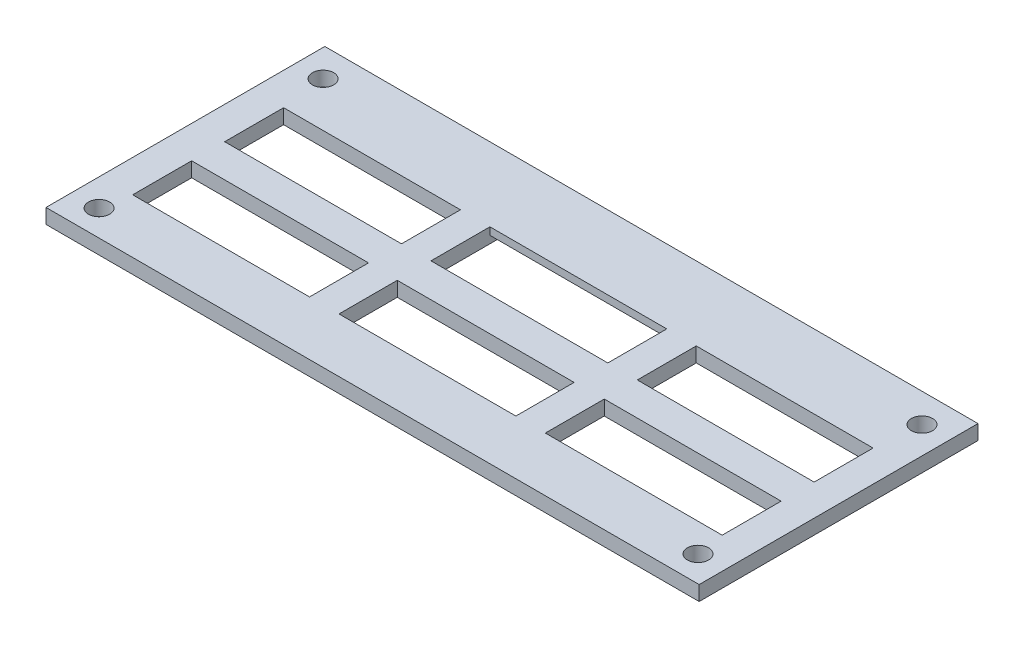
ISO-10303-21;
HEADER;
FILE_DESCRIPTION(('STEP AP214'),'2;1');
FILE_NAME('part.step','',(''),(''),'','','');
FILE_SCHEMA(('AUTOMOTIVE_DESIGN { 1 0 10303 214 1 1 1 1 }'));
ENDSEC;
DATA;
#1=APPLICATION_CONTEXT('core data for automotive mechanical design processes');
#2=APPLICATION_PROTOCOL_DEFINITION('international standard','automotive_design',2000,#1);
#3=PRODUCT_CONTEXT('',#1,'mechanical');
#4=PRODUCT('Part','Part','',(#3));
#5=PRODUCT_RELATED_PRODUCT_CATEGORY('part','',(#4));
#6=PRODUCT_DEFINITION_FORMATION('','',#4);
#7=PRODUCT_DEFINITION_CONTEXT('part definition',#1,'design');
#8=PRODUCT_DEFINITION('design','',#6,#7);
#9=PRODUCT_DEFINITION_SHAPE('','',#8);
#10=(LENGTH_UNIT() NAMED_UNIT(*) SI_UNIT(.MILLI.,.METRE.));
#11=(NAMED_UNIT(*) PLANE_ANGLE_UNIT() SI_UNIT($,.RADIAN.));
#12=(NAMED_UNIT(*) SI_UNIT($,.STERADIAN.) SOLID_ANGLE_UNIT());
#13=UNCERTAINTY_MEASURE_WITH_UNIT(LENGTH_MEASURE(1.E-05),#10,'distance_accuracy_value','');
#14=(GEOMETRIC_REPRESENTATION_CONTEXT(3) GLOBAL_UNCERTAINTY_ASSIGNED_CONTEXT((#13)) GLOBAL_UNIT_ASSIGNED_CONTEXT((#10,
#11,#12)) REPRESENTATION_CONTEXT('',''));
#15=CARTESIAN_POINT('',(0.,0.,0.));
#16=DIRECTION('',(0.,0.,1.));
#17=DIRECTION('',(1.,0.,0.));
#18=AXIS2_PLACEMENT_3D('',#15,#16,#17);
#19=CARTESIAN_POINT('',(0.,3.175,-31.6916788918607));
#20=DIRECTION('',(0.,0.,1.));
#21=DIRECTION('',(1.,0.,0.));
#22=AXIS2_PLACEMENT_3D('',#19,#20,#21);
#23=PLANE('',#22);
#24=DIRECTION('',(0.,-1.,0.));
#25=VECTOR('',#24,1.);
#26=CARTESIAN_POINT('',(19.8707913959619,3.175,-31.6916788918608));
#27=LINE('',#26,#25);
#28=CARTESIAN_POINT('',(19.8707913959619,1.5875,-31.6916788918608));
#29=VERTEX_POINT('',#28);
#30=CARTESIAN_POINT('',(19.8707913959619,0.,-31.6916788918608));
#31=VERTEX_POINT('',#30);
#32=EDGE_CURVE('E38',#29,#31,#27,.T.);
#33=ORIENTED_EDGE('',*,*,#32,.F.);
#34=DIRECTION('',(-1.,0.,0.));
#35=VECTOR('',#34,1.);
#36=CARTESIAN_POINT('',(-18.2292086040381,1.5875,-31.6916788918608));
#37=LINE('',#36,#35);
#38=CARTESIAN_POINT('',(-18.2292086040381,1.5875,-31.6916788918608));
#39=VERTEX_POINT('',#38);
#40=EDGE_CURVE('E421',#29,#39,#37,.T.);
#41=ORIENTED_EDGE('',*,*,#40,.T.);
#42=DIRECTION('',(0.,-1.,0.));
#43=VECTOR('',#42,1.);
#44=CARTESIAN_POINT('',(-18.2292086040381,3.175,-31.6916788918608));
#45=LINE('',#44,#43);
#46=CARTESIAN_POINT('',(-18.2292086040381,0.,-31.6916788918608));
#47=VERTEX_POINT('',#46);
#48=EDGE_CURVE('E269',#39,#47,#45,.T.);
#49=ORIENTED_EDGE('',*,*,#48,.T.);
#50=DIRECTION('',(-1.,0.,0.));
#51=VECTOR('',#50,1.);
#52=CARTESIAN_POINT('',(0.,0.,-31.6916788918607));
#53=LINE('',#52,#51);
#54=EDGE_CURVE('E270',#31,#47,#53,.T.);
#55=ORIENTED_EDGE('',*,*,#54,.F.);
#56=EDGE_LOOP('',(#33,#41,#49,#55));
#57=FACE_BOUND('',#56,.T.);
#58=ADVANCED_FACE('F35',(#57),#23,.T.);
#59=CARTESIAN_POINT('',(0.,3.175,-22.0933789859211));
#60=DIRECTION('',(0.,0.,-1.));
#61=DIRECTION('',(-1.,0.,0.));
#62=AXIS2_PLACEMENT_3D('',#59,#60,#61);
#63=PLANE('',#62);
#64=DIRECTION('',(1.,0.,0.));
#65=VECTOR('',#64,1.);
#66=CARTESIAN_POINT('',(0.,0.,-22.0933789859211));
#67=LINE('',#66,#65);
#68=CARTESIAN_POINT('',(-62.6792086040381,0.,-22.0933789859211));
#69=VERTEX_POINT('',#68);
#70=CARTESIAN_POINT('',(-24.579208604038,0.,-22.0933789859211));
#71=VERTEX_POINT('',#70);
#72=EDGE_CURVE('E332',#69,#71,#67,.T.);
#73=ORIENTED_EDGE('',*,*,#72,.T.);
#74=DIRECTION('',(0.,-1.,0.));
#75=VECTOR('',#74,1.);
#76=CARTESIAN_POINT('',(-24.579208604038,3.175,-22.0933789859211));
#77=LINE('',#76,#75);
#78=CARTESIAN_POINT('',(-24.579208604038,3.175,-22.0933789859211));
#79=VERTEX_POINT('',#78);
#80=EDGE_CURVE('E11',#79,#71,#77,.T.);
#81=ORIENTED_EDGE('',*,*,#80,.F.);
#82=DIRECTION('',(1.,0.,0.));
#83=VECTOR('',#82,1.);
#84=CARTESIAN_POINT('',(0.,3.175,-22.0933789859211));
#85=LINE('',#84,#83);
#86=CARTESIAN_POINT('',(-62.6792086040381,3.175,-22.0933789859211));
#87=VERTEX_POINT('',#86);
#88=EDGE_CURVE('E238',#87,#79,#85,.T.);
#89=ORIENTED_EDGE('',*,*,#88,.F.);
#90=DIRECTION('',(0.,-1.,0.));
#91=VECTOR('',#90,1.);
#92=CARTESIAN_POINT('',(-62.6792086040381,3.175,-22.0933789859211));
#93=LINE('',#92,#91);
#94=EDGE_CURVE('E349',#87,#69,#93,.T.);
#95=ORIENTED_EDGE('',*,*,#94,.T.);
#96=EDGE_LOOP('',(#73,#81,#89,#95));
#97=FACE_BOUND('',#96,.T.);
#98=ADVANCED_FACE('F535',(#97),#63,.F.);
#99=CARTESIAN_POINT('',(-24.579208604038,3.175,0.));
#100=DIRECTION('',(1.,0.,0.));
#101=DIRECTION('',(0.,0.,-1.));
#102=AXIS2_PLACEMENT_3D('',#99,#100,#101);
#103=PLANE('',#102);
#104=DIRECTION('',(0.,0.,1.));
#105=VECTOR('',#104,1.);
#106=CARTESIAN_POINT('',(-24.579208604038,0.,0.));
#107=LINE('',#106,#105);
#108=CARTESIAN_POINT('',(-24.579208604038,0.,-9.39337898592111));
#109=VERTEX_POINT('',#108);
#110=EDGE_CURVE('E245',#71,#109,#107,.T.);
#111=ORIENTED_EDGE('',*,*,#110,.T.);
#112=DIRECTION('',(0.,-1.,0.));
#113=VECTOR('',#112,1.);
#114=CARTESIAN_POINT('',(-24.579208604038,3.175,-9.39337898592111));
#115=LINE('',#114,#113);
#116=CARTESIAN_POINT('',(-24.579208604038,3.175,-9.39337898592111));
#117=VERTEX_POINT('',#116);
#118=EDGE_CURVE('E43',#117,#109,#115,.T.);
#119=ORIENTED_EDGE('',*,*,#118,.F.);
#120=DIRECTION('',(0.,0.,1.));
#121=VECTOR('',#120,1.);
#122=CARTESIAN_POINT('',(-24.579208604038,3.175,0.));
#123=LINE('',#122,#121);
#124=EDGE_CURVE('E230',#79,#117,#123,.T.);
#125=ORIENTED_EDGE('',*,*,#124,.F.);
#126=ORIENTED_EDGE('',*,*,#80,.T.);
#127=EDGE_LOOP('',(#111,#119,#125,#126));
#128=FACE_BOUND('',#127,.T.);
#129=ADVANCED_FACE('F244',(#128),#103,.F.);
#130=CARTESIAN_POINT('',(0.,3.175,-9.39337898592111));
#131=DIRECTION('',(0.,0.,1.));
#132=DIRECTION('',(1.,0.,0.));
#133=AXIS2_PLACEMENT_3D('',#130,#131,#132);
#134=PLANE('',#133);
#135=DIRECTION('',(-1.,0.,0.));
#136=VECTOR('',#135,1.);
#137=CARTESIAN_POINT('',(0.,0.,-9.39337898592111));
#138=LINE('',#137,#136);
#139=CARTESIAN_POINT('',(-62.6792086040381,0.,-9.39337898592111));
#140=VERTEX_POINT('',#139);
#141=EDGE_CURVE('E335',#109,#140,#138,.T.);
#142=ORIENTED_EDGE('',*,*,#141,.T.);
#143=DIRECTION('',(0.,-1.,0.));
#144=VECTOR('',#143,1.);
#145=CARTESIAN_POINT('',(-62.6792086040381,3.175,-9.39337898592111));
#146=LINE('',#145,#144);
#147=CARTESIAN_POINT('',(-62.6792086040381,3.175,-9.39337898592111));
#148=VERTEX_POINT('',#147);
#149=EDGE_CURVE('E248',#148,#140,#146,.T.);
#150=ORIENTED_EDGE('',*,*,#149,.F.);
#151=DIRECTION('',(-1.,0.,0.));
#152=VECTOR('',#151,1.);
#153=CARTESIAN_POINT('',(0.,3.175,-9.39337898592111));
#154=LINE('',#153,#152);
#155=EDGE_CURVE('E235',#117,#148,#154,.T.);
#156=ORIENTED_EDGE('',*,*,#155,.F.);
#157=ORIENTED_EDGE('',*,*,#118,.T.);
#158=EDGE_LOOP('',(#142,#150,#156,#157));
#159=FACE_BOUND('',#158,.T.);
#160=ADVANCED_FACE('F250',(#159),#134,.F.);
#161=CARTESIAN_POINT('',(71.0532617855184,3.175,0.));
#162=DIRECTION('',(-1.,0.,0.));
#163=DIRECTION('',(0.,0.,1.));
#164=AXIS2_PLACEMENT_3D('',#161,#162,#163);
#165=PLANE('',#164);
#166=DIRECTION('',(0.,0.,-1.));
#167=VECTOR('',#166,1.);
#168=CARTESIAN_POINT('',(71.0532617855184,0.,0.));
#169=LINE('',#168,#167);
#170=CARTESIAN_POINT('',(71.0532617855184,0.,22.1095020845851));
#171=VERTEX_POINT('',#170);
#172=CARTESIAN_POINT('',(71.0532617855184,0.,-37.9614970609159));
#173=VERTEX_POINT('',#172);
#174=EDGE_CURVE('E321',#171,#173,#169,.T.);
#175=ORIENTED_EDGE('',*,*,#174,.T.);
#176=DIRECTION('',(0.,-1.,0.));
#177=VECTOR('',#176,1.);
#178=CARTESIAN_POINT('',(71.0532617855184,3.175,-37.9614970609159));
#179=LINE('',#178,#177);
#180=CARTESIAN_POINT('',(71.0532617855184,3.175,-37.9614970609159));
#181=VERTEX_POINT('',#180);
#182=EDGE_CURVE('E351',#181,#173,#179,.T.);
#183=ORIENTED_EDGE('',*,*,#182,.F.);
#184=DIRECTION('',(0.,0.,-1.));
#185=VECTOR('',#184,1.);
#186=CARTESIAN_POINT('',(71.0532617855184,3.175,0.));
#187=LINE('',#186,#185);
#188=CARTESIAN_POINT('',(71.0532617855184,3.175,22.1095020845851));
#189=VERTEX_POINT('',#188);
#190=EDGE_CURVE('E481',#189,#181,#187,.T.);
#191=ORIENTED_EDGE('',*,*,#190,.F.);
#192=DIRECTION('',(0.,-1.,0.));
#193=VECTOR('',#192,1.);
#194=CARTESIAN_POINT('',(71.0532617855184,3.175,22.1095020845851));
#195=LINE('',#194,#193);
#196=EDGE_CURVE('E353',#189,#171,#195,.T.);
#197=ORIENTED_EDGE('',*,*,#196,.T.);
#198=EDGE_LOOP('',(#175,#183,#191,#197));
#199=FACE_BOUND('',#198,.T.);
#200=ADVANCED_FACE('F501',(#199),#165,.F.);
#201=CARTESIAN_POINT('',(0.,3.175,-37.9614970609159));
#202=DIRECTION('',(0.,0.,-1.));
#203=DIRECTION('',(-1.,0.,0.));
#204=AXIS2_PLACEMENT_3D('',#201,#202,#203);
#205=PLANE('',#204);
#206=DIRECTION('',(1.,0.,0.));
#207=VECTOR('',#206,1.);
#208=CARTESIAN_POINT('',(0.,0.,-37.9614970609159));
#209=LINE('',#208,#207);
#210=CARTESIAN_POINT('',(-69.6627359104017,0.,-37.9614970609159));
#211=VERTEX_POINT('',#210);
#212=EDGE_CURVE('E324',#211,#173,#209,.T.);
#213=ORIENTED_EDGE('',*,*,#212,.F.);
#214=DIRECTION('',(0.,-1.,0.));
#215=VECTOR('',#214,1.);
#216=CARTESIAN_POINT('',(-69.6627359104017,3.175,-37.9614970609159));
#217=LINE('',#216,#215);
#218=CARTESIAN_POINT('',(-69.6627359104017,3.175,-37.9614970609159));
#219=VERTEX_POINT('',#218);
#220=EDGE_CURVE('E359',#219,#211,#217,.T.);
#221=ORIENTED_EDGE('',*,*,#220,.F.);
#222=DIRECTION('',(1.,0.,0.));
#223=VECTOR('',#222,1.);
#224=CARTESIAN_POINT('',(0.,3.175,-37.9614970609159));
#225=LINE('',#224,#223);
#226=EDGE_CURVE('E483',#219,#181,#225,.T.);
#227=ORIENTED_EDGE('',*,*,#226,.T.);
#228=ORIENTED_EDGE('',*,*,#182,.T.);
#229=EDGE_LOOP('',(#213,#221,#227,#228));
#230=FACE_BOUND('',#229,.T.);
#231=ADVANCED_FACE('F504',(#230),#205,.T.);
#232=CARTESIAN_POINT('',(-69.6627359104017,3.175,0.));
#233=DIRECTION('',(-1.,0.,0.));
#234=DIRECTION('',(0.,0.,1.));
#235=AXIS2_PLACEMENT_3D('',#232,#233,#234);
#236=PLANE('',#235);
#237=DIRECTION('',(0.,0.,-1.));
#238=VECTOR('',#237,1.);
#239=CARTESIAN_POINT('',(-69.6627359104017,0.,0.));
#240=LINE('',#239,#238);
#241=CARTESIAN_POINT('',(-69.6627359104017,0.,22.1095020845851));
#242=VERTEX_POINT('',#241);
#243=EDGE_CURVE('E327',#242,#211,#240,.T.);
#244=ORIENTED_EDGE('',*,*,#243,.F.);
#245=DIRECTION('',(0.,-1.,0.));
#246=VECTOR('',#245,1.);
#247=CARTESIAN_POINT('',(-69.6627359104017,3.175,22.1095020845851));
#248=LINE('',#247,#246);
#249=CARTESIAN_POINT('',(-69.6627359104017,3.175,22.1095020845851));
#250=VERTEX_POINT('',#249);
#251=EDGE_CURVE('E356',#250,#242,#248,.T.);
#252=ORIENTED_EDGE('',*,*,#251,.F.);
#253=DIRECTION('',(0.,0.,-1.));
#254=VECTOR('',#253,1.);
#255=CARTESIAN_POINT('',(-69.6627359104017,3.175,0.));
#256=LINE('',#255,#254);
#257=EDGE_CURVE('E486',#250,#219,#256,.T.);
#258=ORIENTED_EDGE('',*,*,#257,.T.);
#259=ORIENTED_EDGE('',*,*,#220,.T.);
#260=EDGE_LOOP('',(#244,#252,#258,#259));
#261=FACE_BOUND('',#260,.T.);
#262=ADVANCED_FACE('F507',(#261),#236,.T.);
#263=CARTESIAN_POINT('',(0.,3.175,-2.28137898592111));
#264=DIRECTION('',(0.,0.,1.));
#265=DIRECTION('',(1.,0.,0.));
#266=AXIS2_PLACEMENT_3D('',#263,#264,#265);
#267=PLANE('',#266);
#268=DIRECTION('',(-1.,0.,0.));
#269=VECTOR('',#268,1.);
#270=CARTESIAN_POINT('',(0.,0.,-2.28137898592111));
#271=LINE('',#270,#269);
#272=CARTESIAN_POINT('',(-24.579208604038,0.,-2.28137898592111));
#273=VERTEX_POINT('',#272);
#274=CARTESIAN_POINT('',(-62.6792086040381,0.,-2.28137898592111));
#275=VERTEX_POINT('',#274);
#276=EDGE_CURVE('E312',#273,#275,#271,.T.);
#277=ORIENTED_EDGE('',*,*,#276,.F.);
#278=DIRECTION('',(0.,-1.,0.));
#279=VECTOR('',#278,1.);
#280=CARTESIAN_POINT('',(-24.579208604038,3.175,-2.28137898592111));
#281=LINE('',#280,#279);
#282=CARTESIAN_POINT('',(-24.579208604038,3.175,-2.28137898592111));
#283=VERTEX_POINT('',#282);
#284=EDGE_CURVE('E357',#283,#273,#281,.T.);
#285=ORIENTED_EDGE('',*,*,#284,.F.);
#286=DIRECTION('',(-1.,0.,0.));
#287=VECTOR('',#286,1.);
#288=CARTESIAN_POINT('',(0.,3.175,-2.28137898592111));
#289=LINE('',#288,#287);
#290=CARTESIAN_POINT('',(-62.6792086040381,3.175,-2.28137898592111));
#291=VERTEX_POINT('',#290);
#292=EDGE_CURVE('E477',#283,#291,#289,.T.);
#293=ORIENTED_EDGE('',*,*,#292,.T.);
#294=DIRECTION('',(0.,-1.,0.));
#295=VECTOR('',#294,1.);
#296=CARTESIAN_POINT('',(-62.6792086040381,3.175,-2.28137898592111));
#297=LINE('',#296,#295);
#298=EDGE_CURVE('E362',#291,#275,#297,.T.);
#299=ORIENTED_EDGE('',*,*,#298,.T.);
#300=EDGE_LOOP('',(#277,#285,#293,#299));
#301=FACE_BOUND('',#300,.T.);
#302=ADVANCED_FACE('F554',(#301),#267,.T.);
#303=CARTESIAN_POINT('',(-24.579208604038,0.,10.4186210140789));
#304=VERTEX_POINT('',#303);
#305=EDGE_CURVE('E315',#273,#304,#107,.T.);
#306=ORIENTED_EDGE('',*,*,#305,.T.);
#307=DIRECTION('',(0.,-1.,0.));
#308=VECTOR('',#307,1.);
#309=CARTESIAN_POINT('',(-24.579208604038,3.175,10.4186210140789));
#310=LINE('',#309,#308);
#311=CARTESIAN_POINT('',(-24.579208604038,3.175,10.4186210140789));
#312=VERTEX_POINT('',#311);
#313=EDGE_CURVE('E368',#312,#304,#310,.T.);
#314=ORIENTED_EDGE('',*,*,#313,.F.);
#315=EDGE_CURVE('E242',#283,#312,#123,.T.);
#316=ORIENTED_EDGE('',*,*,#315,.F.);
#317=ORIENTED_EDGE('',*,*,#284,.T.);
#318=EDGE_LOOP('',(#306,#314,#316,#317));
#319=FACE_BOUND('',#318,.T.);
#320=ADVANCED_FACE('F545',(#319),#103,.F.);
#321=CARTESIAN_POINT('',(0.,3.175,10.4186210140789));
#322=DIRECTION('',(0.,0.,1.));
#323=DIRECTION('',(1.,0.,0.));
#324=AXIS2_PLACEMENT_3D('',#321,#322,#323);
#325=PLANE('',#324);
#326=DIRECTION('',(-1.,0.,0.));
#327=VECTOR('',#326,1.);
#328=CARTESIAN_POINT('',(0.,0.,10.4186210140789));
#329=LINE('',#328,#327);
#330=CARTESIAN_POINT('',(-62.6792086040381,0.,10.4186210140789));
#331=VERTEX_POINT('',#330);
#332=EDGE_CURVE('E294',#304,#331,#329,.T.);
#333=ORIENTED_EDGE('',*,*,#332,.T.);
#334=DIRECTION('',(0.,-1.,0.));
#335=VECTOR('',#334,1.);
#336=CARTESIAN_POINT('',(-62.6792086040381,3.175,10.4186210140789));
#337=LINE('',#336,#335);
#338=CARTESIAN_POINT('',(-62.6792086040381,3.175,10.4186210140789));
#339=VERTEX_POINT('',#338);
#340=EDGE_CURVE('E364',#339,#331,#337,.T.);
#341=ORIENTED_EDGE('',*,*,#340,.F.);
#342=DIRECTION('',(-1.,0.,0.));
#343=VECTOR('',#342,1.);
#344=CARTESIAN_POINT('',(0.,3.175,10.4186210140789));
#345=LINE('',#344,#343);
#346=EDGE_CURVE('E460',#312,#339,#345,.T.);
#347=ORIENTED_EDGE('',*,*,#346,.F.);
#348=ORIENTED_EDGE('',*,*,#313,.T.);
#349=EDGE_LOOP('',(#333,#341,#347,#348));
#350=FACE_BOUND('',#349,.T.);
#351=ADVANCED_FACE('F559',(#350),#325,.F.);
#352=CARTESIAN_POINT('',(26.2207913959619,3.175,0.));
#353=DIRECTION('',(1.,0.,0.));
#354=DIRECTION('',(0.,0.,-1.));
#355=AXIS2_PLACEMENT_3D('',#352,#353,#354);
#356=PLANE('',#355);
#357=DIRECTION('',(0.,0.,1.));
#358=VECTOR('',#357,1.);
#359=CARTESIAN_POINT('',(26.2207913959619,0.,0.));
#360=LINE('',#359,#358);
#361=CARTESIAN_POINT('',(26.2207913959619,0.,-22.0933789859211));
#362=VERTEX_POINT('',#361);
#363=CARTESIAN_POINT('',(26.2207913959619,0.,-9.39337898592111));
#364=VERTEX_POINT('',#363);
#365=EDGE_CURVE('E299',#362,#364,#360,.T.);
#366=ORIENTED_EDGE('',*,*,#365,.F.);
#367=DIRECTION('',(0.,-1.,0.));
#368=VECTOR('',#367,1.);
#369=CARTESIAN_POINT('',(26.2207913959619,3.175,-22.0933789859211));
#370=LINE('',#369,#368);
#371=CARTESIAN_POINT('',(26.2207913959619,3.175,-22.0933789859211));
#372=VERTEX_POINT('',#371);
#373=EDGE_CURVE('E365',#372,#362,#370,.T.);
#374=ORIENTED_EDGE('',*,*,#373,.F.);
#375=DIRECTION('',(0.,0.,1.));
#376=VECTOR('',#375,1.);
#377=CARTESIAN_POINT('',(26.2207913959619,3.175,0.));
#378=LINE('',#377,#376);
#379=CARTESIAN_POINT('',(26.2207913959619,3.175,-9.39337898592111));
#380=VERTEX_POINT('',#379);
#381=EDGE_CURVE('E465',#372,#380,#378,.T.);
#382=ORIENTED_EDGE('',*,*,#381,.T.);
#383=DIRECTION('',(0.,-1.,0.));
#384=VECTOR('',#383,1.);
#385=CARTESIAN_POINT('',(26.2207913959619,3.175,-9.39337898592111));
#386=LINE('',#385,#384);
#387=EDGE_CURVE('E372',#380,#364,#386,.T.);
#388=ORIENTED_EDGE('',*,*,#387,.T.);
#389=EDGE_LOOP('',(#366,#374,#382,#388));
#390=FACE_BOUND('',#389,.T.);
#391=ADVANCED_FACE('F562',(#390),#356,.T.);
#392=CARTESIAN_POINT('',(0.,3.175,-22.0933789859211));
#393=DIRECTION('',(0.,0.,1.));
#394=DIRECTION('',(1.,0.,0.));
#395=AXIS2_PLACEMENT_3D('',#392,#393,#394);
#396=PLANE('',#395);
#397=DIRECTION('',(-1.,0.,0.));
#398=VECTOR('',#397,1.);
#399=CARTESIAN_POINT('',(0.,0.,-22.0933789859211));
#400=LINE('',#399,#398);
#401=CARTESIAN_POINT('',(64.3207913959619,0.,-22.0933789859211));
#402=VERTEX_POINT('',#401);
#403=EDGE_CURVE('E306',#402,#362,#400,.T.);
#404=ORIENTED_EDGE('',*,*,#403,.F.);
#405=DIRECTION('',(0.,-1.,0.));
#406=VECTOR('',#405,1.);
#407=CARTESIAN_POINT('',(64.3207913959619,3.175,-22.0933789859211));
#408=LINE('',#407,#406);
#409=CARTESIAN_POINT('',(64.3207913959619,3.175,-22.0933789859211));
#410=VERTEX_POINT('',#409);
#411=EDGE_CURVE('E377',#410,#402,#408,.T.);
#412=ORIENTED_EDGE('',*,*,#411,.F.);
#413=DIRECTION('',(-1.,0.,0.));
#414=VECTOR('',#413,1.);
#415=CARTESIAN_POINT('',(0.,3.175,-22.0933789859211));
#416=LINE('',#415,#414);
#417=EDGE_CURVE('E472',#410,#372,#416,.T.);
#418=ORIENTED_EDGE('',*,*,#417,.T.);
#419=ORIENTED_EDGE('',*,*,#373,.T.);
#420=EDGE_LOOP('',(#404,#412,#418,#419));
#421=FACE_BOUND('',#420,.T.);
#422=ADVANCED_FACE('F576',(#421),#396,.T.);
#423=CARTESIAN_POINT('',(64.3207913959619,3.175,0.));
#424=DIRECTION('',(-1.,0.,0.));
#425=DIRECTION('',(0.,0.,1.));
#426=AXIS2_PLACEMENT_3D('',#423,#424,#425);
#427=PLANE('',#426);
#428=DIRECTION('',(0.,0.,-1.));
#429=VECTOR('',#428,1.);
#430=CARTESIAN_POINT('',(64.3207913959619,0.,0.));
#431=LINE('',#430,#429);
#432=CARTESIAN_POINT('',(64.3207913959619,0.,-9.39337898592111));
#433=VERTEX_POINT('',#432);
#434=EDGE_CURVE('E305',#433,#402,#431,.T.);
#435=ORIENTED_EDGE('',*,*,#434,.F.);
#436=DIRECTION('',(0.,-1.,0.));
#437=VECTOR('',#436,1.);
#438=CARTESIAN_POINT('',(64.3207913959619,3.175,-9.39337898592111));
#439=LINE('',#438,#437);
#440=CARTESIAN_POINT('',(64.3207913959619,3.175,-9.39337898592111));
#441=VERTEX_POINT('',#440);
#442=EDGE_CURVE('E374',#441,#433,#439,.T.);
#443=ORIENTED_EDGE('',*,*,#442,.F.);
#444=DIRECTION('',(0.,0.,-1.));
#445=VECTOR('',#444,1.);
#446=CARTESIAN_POINT('',(64.3207913959619,3.175,0.));
#447=LINE('',#446,#445);
#448=EDGE_CURVE('E471',#441,#410,#447,.T.);
#449=ORIENTED_EDGE('',*,*,#448,.T.);
#450=ORIENTED_EDGE('',*,*,#411,.T.);
#451=EDGE_LOOP('',(#435,#443,#449,#450));
#452=FACE_BOUND('',#451,.T.);
#453=ADVANCED_FACE('F572',(#452),#427,.T.);
#454=CARTESIAN_POINT('',(26.2207913959619,0.,-2.28137898592111));
#455=VERTEX_POINT('',#454);
#456=CARTESIAN_POINT('',(26.2207913959619,0.,10.4186210140789));
#457=VERTEX_POINT('',#456);
#458=EDGE_CURVE('E293',#455,#457,#360,.T.);
#459=ORIENTED_EDGE('',*,*,#458,.F.);
#460=DIRECTION('',(0.,-1.,0.));
#461=VECTOR('',#460,1.);
#462=CARTESIAN_POINT('',(26.2207913959619,3.175,-2.28137898592111));
#463=LINE('',#462,#461);
#464=CARTESIAN_POINT('',(26.2207913959619,3.175,-2.28137898592111));
#465=VERTEX_POINT('',#464);
#466=EDGE_CURVE('E375',#465,#455,#463,.T.);
#467=ORIENTED_EDGE('',*,*,#466,.F.);
#468=CARTESIAN_POINT('',(26.2207913959619,3.175,10.4186210140789));
#469=VERTEX_POINT('',#468);
#470=EDGE_CURVE('E459',#465,#469,#378,.T.);
#471=ORIENTED_EDGE('',*,*,#470,.T.);
#472=DIRECTION('',(0.,-1.,0.));
#473=VECTOR('',#472,1.);
#474=CARTESIAN_POINT('',(26.2207913959619,3.175,10.4186210140789));
#475=LINE('',#474,#473);
#476=EDGE_CURVE('E380',#469,#457,#475,.T.);
#477=ORIENTED_EDGE('',*,*,#476,.T.);
#478=EDGE_LOOP('',(#459,#467,#471,#477));
#479=FACE_BOUND('',#478,.T.);
#480=ADVANCED_FACE('F575',(#479),#356,.T.);
#481=CARTESIAN_POINT('',(0.,3.175,-2.2813789859211));
#482=DIRECTION('',(0.,0.,1.));
#483=DIRECTION('',(1.,0.,0.));
#484=AXIS2_PLACEMENT_3D('',#481,#482,#483);
#485=PLANE('',#484);
#486=DIRECTION('',(-1.,0.,0.));
#487=VECTOR('',#486,1.);
#488=CARTESIAN_POINT('',(0.,0.,-2.2813789859211));
#489=LINE('',#488,#487);
#490=CARTESIAN_POINT('',(64.3207913959619,0.,-2.28137898592111));
#491=VERTEX_POINT('',#490);
#492=EDGE_CURVE('E298',#491,#455,#489,.T.);
#493=ORIENTED_EDGE('',*,*,#492,.F.);
#494=DIRECTION('',(0.,-1.,0.));
#495=VECTOR('',#494,1.);
#496=CARTESIAN_POINT('',(64.3207913959619,3.175,-2.28137898592111));
#497=LINE('',#496,#495);
#498=CARTESIAN_POINT('',(64.3207913959619,3.175,-2.28137898592111));
#499=VERTEX_POINT('',#498);
#500=EDGE_CURVE('E385',#499,#491,#497,.T.);
#501=ORIENTED_EDGE('',*,*,#500,.F.);
#502=DIRECTION('',(-1.,0.,0.));
#503=VECTOR('',#502,1.);
#504=CARTESIAN_POINT('',(0.,3.175,-2.2813789859211));
#505=LINE('',#504,#503);
#506=EDGE_CURVE('E464',#499,#465,#505,.T.);
#507=ORIENTED_EDGE('',*,*,#506,.T.);
#508=ORIENTED_EDGE('',*,*,#466,.T.);
#509=EDGE_LOOP('',(#493,#501,#507,#508));
#510=FACE_BOUND('',#509,.T.);
#511=ADVANCED_FACE('F585',(#510),#485,.T.);
#512=CARTESIAN_POINT('',(64.3207913959619,0.,10.4186210140789));
#513=VERTEX_POINT('',#512);
#514=EDGE_CURVE('E302',#513,#491,#431,.T.);
#515=ORIENTED_EDGE('',*,*,#514,.F.);
#516=DIRECTION('',(0.,-1.,0.));
#517=VECTOR('',#516,1.);
#518=CARTESIAN_POINT('',(64.3207913959619,3.175,10.4186210140789));
#519=LINE('',#518,#517);
#520=CARTESIAN_POINT('',(64.3207913959619,3.175,10.4186210140789));
#521=VERTEX_POINT('',#520);
#522=EDGE_CURVE('E382',#521,#513,#519,.T.);
#523=ORIENTED_EDGE('',*,*,#522,.F.);
#524=EDGE_CURVE('E468',#521,#499,#447,.T.);
#525=ORIENTED_EDGE('',*,*,#524,.T.);
#526=ORIENTED_EDGE('',*,*,#500,.T.);
#527=EDGE_LOOP('',(#515,#523,#525,#526));
#528=FACE_BOUND('',#527,.T.);
#529=ADVANCED_FACE('F578',(#528),#427,.T.);
#530=CARTESIAN_POINT('',(-18.2292086040381,3.175,0.));
#531=DIRECTION('',(1.,0.,0.));
#532=DIRECTION('',(0.,0.,-1.));
#533=AXIS2_PLACEMENT_3D('',#530,#531,#532);
#534=PLANE('',#533);
#535=DIRECTION('',(0.,0.,1.));
#536=VECTOR('',#535,1.);
#537=CARTESIAN_POINT('',(-18.2292086040381,0.,0.));
#538=LINE('',#537,#536);
#539=CARTESIAN_POINT('',(-18.2292086040381,0.,-2.13013707466614));
#540=VERTEX_POINT('',#539);
#541=CARTESIAN_POINT('',(-18.2292086040381,0.,10.4186210140789));
#542=VERTEX_POINT('',#541);
#543=EDGE_CURVE('E284',#540,#542,#538,.T.);
#544=ORIENTED_EDGE('',*,*,#543,.F.);
#545=DIRECTION('',(0.,-1.,0.));
#546=VECTOR('',#545,1.);
#547=CARTESIAN_POINT('',(-18.2292086040381,3.175,-2.13013707466614));
#548=LINE('',#547,#546);
#549=CARTESIAN_POINT('',(-18.2292086040381,3.175,-2.13013707466614));
#550=VERTEX_POINT('',#549);
#551=EDGE_CURVE('E383',#550,#540,#548,.T.);
#552=ORIENTED_EDGE('',*,*,#551,.F.);
#553=DIRECTION('',(0.,0.,1.));
#554=VECTOR('',#553,1.);
#555=CARTESIAN_POINT('',(-18.2292086040381,3.175,0.));
#556=LINE('',#555,#554);
#557=CARTESIAN_POINT('',(-18.2292086040381,3.175,10.4186210140789));
#558=VERTEX_POINT('',#557);
#559=EDGE_CURVE('E446',#550,#558,#556,.T.);
#560=ORIENTED_EDGE('',*,*,#559,.T.);
#561=DIRECTION('',(0.,-1.,0.));
#562=VECTOR('',#561,1.);
#563=CARTESIAN_POINT('',(-18.2292086040381,3.175,10.4186210140789));
#564=LINE('',#563,#562);
#565=EDGE_CURVE('E388',#558,#542,#564,.T.);
#566=ORIENTED_EDGE('',*,*,#565,.T.);
#567=EDGE_LOOP('',(#544,#552,#560,#566));
#568=FACE_BOUND('',#567,.T.);
#569=ADVANCED_FACE('F596',(#568),#534,.T.);
#570=CARTESIAN_POINT('',(0.,3.175,-2.13013707466614));
#571=DIRECTION('',(0.,0.,-1.));
#572=DIRECTION('',(-1.,0.,0.));
#573=AXIS2_PLACEMENT_3D('',#570,#571,#572);
#574=PLANE('',#573);
#575=DIRECTION('',(1.,0.,0.));
#576=VECTOR('',#575,1.);
#577=CARTESIAN_POINT('',(0.,0.,-2.13013707466614));
#578=LINE('',#577,#576);
#579=CARTESIAN_POINT('',(19.8707913959619,0.,-2.13013707466614));
#580=VERTEX_POINT('',#579);
#581=EDGE_CURVE('E287',#540,#580,#578,.T.);
#582=ORIENTED_EDGE('',*,*,#581,.T.);
#583=DIRECTION('',(0.,-1.,0.));
#584=VECTOR('',#583,1.);
#585=CARTESIAN_POINT('',(19.8707913959619,3.175,-2.13013707466614));
#586=LINE('',#585,#584);
#587=CARTESIAN_POINT('',(19.8707913959619,3.175,-2.13013707466614));
#588=VERTEX_POINT('',#587);
#589=EDGE_CURVE('E393',#588,#580,#586,.T.);
#590=ORIENTED_EDGE('',*,*,#589,.F.);
#591=DIRECTION('',(1.,0.,0.));
#592=VECTOR('',#591,1.);
#593=CARTESIAN_POINT('',(0.,3.175,-2.13013707466614));
#594=LINE('',#593,#592);
#595=EDGE_CURVE('E449',#550,#588,#594,.T.);
#596=ORIENTED_EDGE('',*,*,#595,.F.);
#597=ORIENTED_EDGE('',*,*,#551,.T.);
#598=EDGE_LOOP('',(#582,#590,#596,#597));
#599=FACE_BOUND('',#598,.T.);
#600=ADVANCED_FACE('F592',(#599),#574,.F.);
#601=CARTESIAN_POINT('',(19.8707913959619,3.175,0.));
#602=DIRECTION('',(1.,0.,0.));
#603=DIRECTION('',(0.,0.,-1.));
#604=AXIS2_PLACEMENT_3D('',#601,#602,#603);
#605=PLANE('',#604);
#606=DIRECTION('',(0.,0.,1.));
#607=VECTOR('',#606,1.);
#608=CARTESIAN_POINT('',(19.8707913959619,0.,0.));
#609=LINE('',#608,#607);
#610=CARTESIAN_POINT('',(19.8707913959619,0.,10.4186210140789));
#611=VERTEX_POINT('',#610);
#612=EDGE_CURVE('E278',#580,#611,#609,.T.);
#613=ORIENTED_EDGE('',*,*,#612,.T.);
#614=DIRECTION('',(0.,-1.,0.));
#615=VECTOR('',#614,1.);
#616=CARTESIAN_POINT('',(19.8707913959619,3.175,10.4186210140789));
#617=LINE('',#616,#615);
#618=CARTESIAN_POINT('',(19.8707913959619,3.175,10.4186210140789));
#619=VERTEX_POINT('',#618);
#620=EDGE_CURVE('E390',#619,#611,#617,.T.);
#621=ORIENTED_EDGE('',*,*,#620,.F.);
#622=DIRECTION('',(0.,0.,1.));
#623=VECTOR('',#622,1.);
#624=CARTESIAN_POINT('',(19.8707913959619,3.175,0.));
#625=LINE('',#624,#623);
#626=EDGE_CURVE('E456',#588,#619,#625,.T.);
#627=ORIENTED_EDGE('',*,*,#626,.F.);
#628=ORIENTED_EDGE('',*,*,#589,.T.);
#629=EDGE_LOOP('',(#613,#621,#627,#628));
#630=FACE_BOUND('',#629,.T.);
#631=ADVANCED_FACE('F589',(#630),#605,.F.);
#632=CARTESIAN_POINT('',(19.8707913959619,3.175,-22.0933789859211));
#633=VERTEX_POINT('',#632);
#634=CARTESIAN_POINT('',(19.8707913959619,3.175,-9.39337898592111));
#635=VERTEX_POINT('',#634);
#636=EDGE_CURVE('E159',#633,#635,#625,.T.);
#637=ORIENTED_EDGE('',*,*,#636,.F.);
#638=DIRECTION('',(0.,1.,0.));
#639=VECTOR('',#638,1.);
#640=CARTESIAN_POINT('',(19.8707913959619,1.5875,-22.0933789859211));
#641=LINE('',#640,#639);
#642=CARTESIAN_POINT('',(19.8707913959619,1.5875,-22.0933789859211));
#643=VERTEX_POINT('',#642);
#644=EDGE_CURVE('E274',#643,#633,#641,.T.);
#645=ORIENTED_EDGE('',*,*,#644,.F.);
#646=DIRECTION('',(0.,0.,-1.));
#647=VECTOR('',#646,1.);
#648=CARTESIAN_POINT('',(19.8707913959619,1.5875,-31.6916788918608));
#649=LINE('',#648,#647);
#650=EDGE_CURVE('E411',#643,#29,#649,.T.);
#651=ORIENTED_EDGE('',*,*,#650,.T.);
#652=ORIENTED_EDGE('',*,*,#32,.T.);
#653=CARTESIAN_POINT('',(19.8707913959619,0.,-9.39337898592111));
#654=VERTEX_POINT('',#653);
#655=EDGE_CURVE('E273',#31,#654,#609,.T.);
#656=ORIENTED_EDGE('',*,*,#655,.T.);
#657=DIRECTION('',(0.,-1.,0.));
#658=VECTOR('',#657,1.);
#659=CARTESIAN_POINT('',(19.8707913959619,3.175,-9.39337898592111));
#660=LINE('',#659,#658);
#661=EDGE_CURVE('E399',#635,#654,#660,.T.);
#662=ORIENTED_EDGE('',*,*,#661,.F.);
#663=EDGE_LOOP('',(#637,#645,#651,#652,#656,#662));
#664=FACE_BOUND('',#663,.T.);
#665=ADVANCED_FACE('F407',(#664),#605,.F.);
#666=CARTESIAN_POINT('',(0.,3.175,-9.39337898592111));
#667=DIRECTION('',(0.,0.,-1.));
#668=DIRECTION('',(-1.,0.,0.));
#669=AXIS2_PLACEMENT_3D('',#666,#667,#668);
#670=PLANE('',#669);
#671=DIRECTION('',(1.,0.,0.));
#672=VECTOR('',#671,1.);
#673=CARTESIAN_POINT('',(0.,0.,-9.39337898592111));
#674=LINE('',#673,#672);
#675=CARTESIAN_POINT('',(-18.2292086040381,0.,-9.39337898592111));
#676=VERTEX_POINT('',#675);
#677=EDGE_CURVE('E277',#676,#654,#674,.T.);
#678=ORIENTED_EDGE('',*,*,#677,.F.);
#679=DIRECTION('',(0.,-1.,0.));
#680=VECTOR('',#679,1.);
#681=CARTESIAN_POINT('',(-18.2292086040381,3.175,-9.39337898592111));
#682=LINE('',#681,#680);
#683=CARTESIAN_POINT('',(-18.2292086040381,3.175,-9.39337898592111));
#684=VERTEX_POINT('',#683);
#685=EDGE_CURVE('E398',#684,#676,#682,.T.);
#686=ORIENTED_EDGE('',*,*,#685,.F.);
#687=DIRECTION('',(1.,0.,0.));
#688=VECTOR('',#687,1.);
#689=CARTESIAN_POINT('',(0.,3.175,-9.39337898592111));
#690=LINE('',#689,#688);
#691=EDGE_CURVE('E445',#684,#635,#690,.T.);
#692=ORIENTED_EDGE('',*,*,#691,.T.);
#693=ORIENTED_EDGE('',*,*,#661,.T.);
#694=EDGE_LOOP('',(#678,#686,#692,#693));
#695=FACE_BOUND('',#694,.T.);
#696=ADVANCED_FACE('F600',(#695),#670,.T.);
#697=CARTESIAN_POINT('',(-63.8207355289316,3.175,-31.7384962674659));
#698=DIRECTION('',(0.,-1.,0.));
#699=DIRECTION('',(0.,0.,-1.));
#700=AXIS2_PLACEMENT_3D('',#697,#698,#699);
#701=CYLINDRICAL_SURFACE('',#700,2.28599999999999);
#702=CARTESIAN_POINT('',(-63.8207355289316,3.175,-31.7384962674659));
#703=DIRECTION('',(0.,1.,0.));
#704=DIRECTION('',(0.,0.,1.));
#705=AXIS2_PLACEMENT_3D('',#702,#703,#704);
#706=CIRCLE('',#705,2.28599999999999);
#707=CARTESIAN_POINT('',(-63.8207355289316,3.175,-29.4524962674659));
#708=VERTEX_POINT('',#707);
#709=EDGE_CURVE('E263',#708,#708,#706,.T.);
#710=ORIENTED_EDGE('',*,*,#709,.T.);
#711=EDGE_LOOP('',(#710));
#712=FACE_BOUND('',#711,.T.);
#713=CARTESIAN_POINT('',(-63.8207355289316,0.,-31.7384962674659));
#714=DIRECTION('',(0.,1.,0.));
#715=DIRECTION('',(0.,0.,1.));
#716=AXIS2_PLACEMENT_3D('',#713,#714,#715);
#717=CIRCLE('',#716,2.28599999999999);
#718=CARTESIAN_POINT('',(-63.8207355289316,0.,-29.4524962674659));
#719=VERTEX_POINT('',#718);
#720=EDGE_CURVE('E343',#719,#719,#717,.T.);
#721=ORIENTED_EDGE('',*,*,#720,.F.);
#722=EDGE_LOOP('',(#721));
#723=FACE_BOUND('',#722,.T.);
#724=ADVANCED_FACE('F602',(#712,#723),#701,.F.);
#725=CARTESIAN_POINT('',(-63.8207355289316,3.175,16.5215037325341));
#726=DIRECTION('',(0.,-1.,0.));
#727=DIRECTION('',(0.,0.,-1.));
#728=AXIS2_PLACEMENT_3D('',#725,#726,#727);
#729=CYLINDRICAL_SURFACE('',#728,2.28599999999999);
#730=CARTESIAN_POINT('',(-63.8207355289316,3.175,16.5215037325341));
#731=DIRECTION('',(0.,1.,0.));
#732=DIRECTION('',(0.,0.,1.));
#733=AXIS2_PLACEMENT_3D('',#730,#731,#732);
#734=CIRCLE('',#733,2.28599999999999);
#735=CARTESIAN_POINT('',(-63.8207355289316,3.175,18.8075037325341));
#736=VERTEX_POINT('',#735);
#737=EDGE_CURVE('E260',#736,#736,#734,.T.);
#738=ORIENTED_EDGE('',*,*,#737,.T.);
#739=EDGE_LOOP('',(#738));
#740=FACE_BOUND('',#739,.T.);
#741=CARTESIAN_POINT('',(-63.8207355289316,0.,16.5215037325341));
#742=DIRECTION('',(0.,1.,0.));
#743=DIRECTION('',(0.,0.,1.));
#744=AXIS2_PLACEMENT_3D('',#741,#742,#743);
#745=CIRCLE('',#744,2.28599999999999);
#746=CARTESIAN_POINT('',(-63.8207355289316,0.,18.8075037325341));
#747=VERTEX_POINT('',#746);
#748=EDGE_CURVE('E340',#747,#747,#745,.T.);
#749=ORIENTED_EDGE('',*,*,#748,.F.);
#750=EDGE_LOOP('',(#749));
#751=FACE_BOUND('',#750,.T.);
#752=ADVANCED_FACE('F607',(#740,#751),#729,.F.);
#753=CARTESIAN_POINT('',(65.2112644710684,3.175,16.5215037325341));
#754=DIRECTION('',(0.,-1.,0.));
#755=DIRECTION('',(0.,0.,-1.));
#756=AXIS2_PLACEMENT_3D('',#753,#754,#755);
#757=CYLINDRICAL_SURFACE('',#756,2.28599999999999);
#758=CARTESIAN_POINT('',(65.2112644710684,3.175,16.5215037325341));
#759=DIRECTION('',(0.,1.,0.));
#760=DIRECTION('',(0.,0.,1.));
#761=AXIS2_PLACEMENT_3D('',#758,#759,#760);
#762=CIRCLE('',#761,2.28599999999999);
#763=CARTESIAN_POINT('',(65.2112644710684,3.175,18.8075037325341));
#764=VERTEX_POINT('',#763);
#765=EDGE_CURVE('E252',#764,#764,#762,.T.);
#766=ORIENTED_EDGE('',*,*,#765,.T.);
#767=EDGE_LOOP('',(#766));
#768=FACE_BOUND('',#767,.T.);
#769=CARTESIAN_POINT('',(65.2112644710684,0.,16.5215037325341));
#770=DIRECTION('',(0.,1.,0.));
#771=DIRECTION('',(0.,0.,1.));
#772=AXIS2_PLACEMENT_3D('',#769,#770,#771);
#773=CIRCLE('',#772,2.28599999999999);
#774=CARTESIAN_POINT('',(65.2112644710684,0.,18.8075037325341));
#775=VERTEX_POINT('',#774);
#776=EDGE_CURVE('E337',#775,#775,#773,.T.);
#777=ORIENTED_EDGE('',*,*,#776,.F.);
#778=EDGE_LOOP('',(#777));
#779=FACE_BOUND('',#778,.T.);
#780=ADVANCED_FACE('F816',(#768,#779),#757,.F.);
#781=CARTESIAN_POINT('',(-62.6792086040381,3.175,0.));
#782=DIRECTION('',(-1.,0.,0.));
#783=DIRECTION('',(0.,0.,1.));
#784=AXIS2_PLACEMENT_3D('',#781,#782,#783);
#785=PLANE('',#784);
#786=DIRECTION('',(0.,0.,-1.));
#787=VECTOR('',#786,1.);
#788=CARTESIAN_POINT('',(-62.6792086040381,0.,0.));
#789=LINE('',#788,#787);
#790=EDGE_CURVE('E153',#140,#69,#789,.T.);
#791=ORIENTED_EDGE('',*,*,#790,.T.);
#792=ORIENTED_EDGE('',*,*,#94,.F.);
#793=DIRECTION('',(0.,0.,-1.));
#794=VECTOR('',#793,1.);
#795=CARTESIAN_POINT('',(-62.6792086040381,3.175,0.));
#796=LINE('',#795,#794);
#797=EDGE_CURVE('E60',#148,#87,#796,.T.);
#798=ORIENTED_EDGE('',*,*,#797,.F.);
#799=ORIENTED_EDGE('',*,*,#149,.T.);
#800=EDGE_LOOP('',(#791,#792,#798,#799));
#801=FACE_BOUND('',#800,.T.);
#802=ADVANCED_FACE('F551',(#801),#785,.F.);
#803=CARTESIAN_POINT('',(0.,3.175,22.1095020845851));
#804=DIRECTION('',(0.,0.,-1.));
#805=DIRECTION('',(-1.,0.,0.));
#806=AXIS2_PLACEMENT_3D('',#803,#804,#805);
#807=PLANE('',#806);
#808=DIRECTION('',(1.,0.,0.));
#809=VECTOR('',#808,1.);
#810=CARTESIAN_POINT('',(0.,0.,22.1095020845851));
#811=LINE('',#810,#809);
#812=EDGE_CURVE('E330',#242,#171,#811,.T.);
#813=ORIENTED_EDGE('',*,*,#812,.T.);
#814=ORIENTED_EDGE('',*,*,#196,.F.);
#815=DIRECTION('',(1.,0.,0.));
#816=VECTOR('',#815,1.);
#817=CARTESIAN_POINT('',(0.,3.175,22.1095020845851));
#818=LINE('',#817,#816);
#819=EDGE_CURVE('E488',#250,#189,#818,.T.);
#820=ORIENTED_EDGE('',*,*,#819,.F.);
#821=ORIENTED_EDGE('',*,*,#251,.T.);
#822=EDGE_LOOP('',(#813,#814,#820,#821));
#823=FACE_BOUND('',#822,.T.);
#824=ADVANCED_FACE('F497',(#823),#807,.F.);
#825=EDGE_CURVE('E318',#331,#275,#789,.T.);
#826=ORIENTED_EDGE('',*,*,#825,.T.);
#827=ORIENTED_EDGE('',*,*,#298,.F.);
#828=EDGE_CURVE('E254',#339,#291,#796,.T.);
#829=ORIENTED_EDGE('',*,*,#828,.F.);
#830=ORIENTED_EDGE('',*,*,#340,.T.);
#831=EDGE_LOOP('',(#826,#827,#829,#830));
#832=FACE_BOUND('',#831,.T.);
#833=ADVANCED_FACE('F550',(#832),#785,.F.);
#834=CARTESIAN_POINT('',(0.,3.175,-9.39337898592109));
#835=DIRECTION('',(0.,0.,1.));
#836=DIRECTION('',(1.,0.,0.));
#837=AXIS2_PLACEMENT_3D('',#834,#835,#836);
#838=PLANE('',#837);
#839=DIRECTION('',(-1.,0.,0.));
#840=VECTOR('',#839,1.);
#841=CARTESIAN_POINT('',(0.,0.,-9.39337898592109));
#842=LINE('',#841,#840);
#843=EDGE_CURVE('E309',#433,#364,#842,.T.);
#844=ORIENTED_EDGE('',*,*,#843,.T.);
#845=ORIENTED_EDGE('',*,*,#387,.F.);
#846=DIRECTION('',(-1.,0.,0.));
#847=VECTOR('',#846,1.);
#848=CARTESIAN_POINT('',(0.,3.175,-9.39337898592109));
#849=LINE('',#848,#847);
#850=EDGE_CURVE('E475',#441,#380,#849,.T.);
#851=ORIENTED_EDGE('',*,*,#850,.F.);
#852=ORIENTED_EDGE('',*,*,#442,.T.);
#853=EDGE_LOOP('',(#844,#845,#851,#852));
#854=FACE_BOUND('',#853,.T.);
#855=ADVANCED_FACE('F568',(#854),#838,.F.);
#856=EDGE_CURVE('E295',#513,#457,#329,.T.);
#857=ORIENTED_EDGE('',*,*,#856,.T.);
#858=ORIENTED_EDGE('',*,*,#476,.F.);
#859=EDGE_CURVE('E461',#521,#469,#345,.T.);
#860=ORIENTED_EDGE('',*,*,#859,.F.);
#861=ORIENTED_EDGE('',*,*,#522,.T.);
#862=EDGE_LOOP('',(#857,#858,#860,#861));
#863=FACE_BOUND('',#862,.T.);
#864=ADVANCED_FACE('F564',(#863),#325,.F.);
#865=EDGE_CURVE('E290',#611,#542,#329,.T.);
#866=ORIENTED_EDGE('',*,*,#865,.T.);
#867=ORIENTED_EDGE('',*,*,#565,.F.);
#868=EDGE_CURVE('E457',#619,#558,#345,.T.);
#869=ORIENTED_EDGE('',*,*,#868,.F.);
#870=ORIENTED_EDGE('',*,*,#620,.T.);
#871=EDGE_LOOP('',(#866,#867,#869,#870));
#872=FACE_BOUND('',#871,.T.);
#873=ADVANCED_FACE('F531',(#872),#325,.F.);
#874=CARTESIAN_POINT('',(-18.2292086040381,3.175,0.));
#875=DIRECTION('',(1.,0.,0.));
#876=DIRECTION('',(0.,0.,-1.));
#877=AXIS2_PLACEMENT_3D('',#874,#875,#876);
#878=PLANE('',#877);
#879=DIRECTION('',(0.,1.,0.));
#880=VECTOR('',#879,1.);
#881=CARTESIAN_POINT('',(-18.2292086040381,1.5875,-22.0933789859211));
#882=LINE('',#881,#880);
#883=CARTESIAN_POINT('',(-18.2292086040381,1.5875,-22.0933789859211));
#884=VERTEX_POINT('',#883);
#885=CARTESIAN_POINT('',(-18.2292086040381,3.175,-22.0933789859211));
#886=VERTEX_POINT('',#885);
#887=EDGE_CURVE('E438',#884,#886,#882,.T.);
#888=ORIENTED_EDGE('',*,*,#887,.T.);
#889=DIRECTION('',(0.,0.,1.));
#890=VECTOR('',#889,1.);
#891=CARTESIAN_POINT('',(-18.2292086040381,3.175,0.));
#892=LINE('',#891,#890);
#893=EDGE_CURVE('E441',#886,#684,#892,.T.);
#894=ORIENTED_EDGE('',*,*,#893,.T.);
#895=ORIENTED_EDGE('',*,*,#685,.T.);
#896=DIRECTION('',(0.,0.,1.));
#897=VECTOR('',#896,1.);
#898=CARTESIAN_POINT('',(-18.2292086040381,0.,0.));
#899=LINE('',#898,#897);
#900=EDGE_CURVE('E281',#47,#676,#899,.T.);
#901=ORIENTED_EDGE('',*,*,#900,.F.);
#902=ORIENTED_EDGE('',*,*,#48,.F.);
#903=DIRECTION('',(0.,0.,1.));
#904=VECTOR('',#903,1.);
#905=CARTESIAN_POINT('',(-18.2292086040381,1.5875,-31.6916788918608));
#906=LINE('',#905,#904);
#907=EDGE_CURVE('E428',#39,#884,#906,.T.);
#908=ORIENTED_EDGE('',*,*,#907,.T.);
#909=EDGE_LOOP('',(#888,#894,#895,#901,#902,#908));
#910=FACE_BOUND('',#909,.T.);
#911=ADVANCED_FACE('F425',(#910),#878,.T.);
#912=CARTESIAN_POINT('',(65.2112644710684,3.175,-31.7384962674659));
#913=DIRECTION('',(0.,-1.,0.));
#914=DIRECTION('',(0.,0.,-1.));
#915=AXIS2_PLACEMENT_3D('',#912,#913,#914);
#916=CYLINDRICAL_SURFACE('',#915,2.28599999999999);
#917=CARTESIAN_POINT('',(65.2112644710684,3.175,-31.7384962674659));
#918=DIRECTION('',(0.,1.,0.));
#919=DIRECTION('',(0.,0.,1.));
#920=AXIS2_PLACEMENT_3D('',#917,#918,#919);
#921=CIRCLE('',#920,2.28599999999999);
#922=CARTESIAN_POINT('',(65.2112644710684,3.175,-29.4524962674659));
#923=VERTEX_POINT('',#922);
#924=EDGE_CURVE('E266',#923,#923,#921,.T.);
#925=ORIENTED_EDGE('',*,*,#924,.T.);
#926=EDGE_LOOP('',(#925));
#927=FACE_BOUND('',#926,.T.);
#928=CARTESIAN_POINT('',(65.2112644710684,0.,-31.7384962674659));
#929=DIRECTION('',(0.,1.,0.));
#930=DIRECTION('',(0.,0.,1.));
#931=AXIS2_PLACEMENT_3D('',#928,#929,#930);
#932=CIRCLE('',#931,2.28599999999999);
#933=CARTESIAN_POINT('',(65.2112644710684,0.,-29.4524962674659));
#934=VERTEX_POINT('',#933);
#935=EDGE_CURVE('E346',#934,#934,#932,.T.);
#936=ORIENTED_EDGE('',*,*,#935,.F.);
#937=EDGE_LOOP('',(#936));
#938=FACE_BOUND('',#937,.T.);
#939=ADVANCED_FACE('F522',(#927,#938),#916,.F.);
#940=CARTESIAN_POINT('',(0.,3.175,0.));
#941=DIRECTION('',(0.,1.,0.));
#942=DIRECTION('',(0.,0.,1.));
#943=AXIS2_PLACEMENT_3D('',#940,#941,#942);
#944=PLANE('',#943);
#945=ORIENTED_EDGE('',*,*,#893,.F.);
#946=DIRECTION('',(1.,0.,0.));
#947=VECTOR('',#946,1.);
#948=CARTESIAN_POINT('',(-18.2292086040381,3.175,-22.0933789859211));
#949=LINE('',#948,#947);
#950=EDGE_CURVE('E51',#886,#633,#949,.T.);
#951=ORIENTED_EDGE('',*,*,#950,.T.);
#952=ORIENTED_EDGE('',*,*,#636,.T.);
#953=ORIENTED_EDGE('',*,*,#691,.F.);
#954=EDGE_LOOP('',(#945,#951,#952,#953));
#955=FACE_BOUND('',#954,.T.);
#956=ORIENTED_EDGE('',*,*,#559,.F.);
#957=ORIENTED_EDGE('',*,*,#595,.T.);
#958=ORIENTED_EDGE('',*,*,#626,.T.);
#959=ORIENTED_EDGE('',*,*,#868,.T.);
#960=EDGE_LOOP('',(#956,#957,#958,#959));
#961=FACE_BOUND('',#960,.T.);
#962=ORIENTED_EDGE('',*,*,#470,.F.);
#963=ORIENTED_EDGE('',*,*,#506,.F.);
#964=ORIENTED_EDGE('',*,*,#524,.F.);
#965=ORIENTED_EDGE('',*,*,#859,.T.);
#966=EDGE_LOOP('',(#962,#963,#964,#965));
#967=FACE_BOUND('',#966,.T.);
#968=ORIENTED_EDGE('',*,*,#381,.F.);
#969=ORIENTED_EDGE('',*,*,#417,.F.);
#970=ORIENTED_EDGE('',*,*,#448,.F.);
#971=ORIENTED_EDGE('',*,*,#850,.T.);
#972=EDGE_LOOP('',(#968,#969,#970,#971));
#973=FACE_BOUND('',#972,.T.);
#974=ORIENTED_EDGE('',*,*,#292,.F.);
#975=ORIENTED_EDGE('',*,*,#315,.T.);
#976=ORIENTED_EDGE('',*,*,#346,.T.);
#977=ORIENTED_EDGE('',*,*,#828,.T.);
#978=EDGE_LOOP('',(#974,#975,#976,#977));
#979=FACE_BOUND('',#978,.T.);
#980=ORIENTED_EDGE('',*,*,#190,.T.);
#981=ORIENTED_EDGE('',*,*,#226,.F.);
#982=ORIENTED_EDGE('',*,*,#257,.F.);
#983=ORIENTED_EDGE('',*,*,#819,.T.);
#984=EDGE_LOOP('',(#980,#981,#982,#983));
#985=FACE_BOUND('',#984,.T.);
#986=ORIENTED_EDGE('',*,*,#88,.T.);
#987=ORIENTED_EDGE('',*,*,#124,.T.);
#988=ORIENTED_EDGE('',*,*,#155,.T.);
#989=ORIENTED_EDGE('',*,*,#797,.T.);
#990=EDGE_LOOP('',(#986,#987,#988,#989));
#991=FACE_BOUND('',#990,.T.);
#992=ORIENTED_EDGE('',*,*,#765,.F.);
#993=EDGE_LOOP('',(#992));
#994=FACE_BOUND('',#993,.T.);
#995=ORIENTED_EDGE('',*,*,#737,.F.);
#996=EDGE_LOOP('',(#995));
#997=FACE_BOUND('',#996,.T.);
#998=ORIENTED_EDGE('',*,*,#709,.F.);
#999=EDGE_LOOP('',(#998));
#1000=FACE_BOUND('',#999,.T.);
#1001=ORIENTED_EDGE('',*,*,#924,.F.);
#1002=EDGE_LOOP('',(#1001));
#1003=FACE_BOUND('',#1002,.T.);
#1004=ADVANCED_FACE('F232',(#955,#961,#967,#973,#979,#985,#991,#994,#997,#1000,#1003),#944,.T.);
#1005=CARTESIAN_POINT('',(0.,0.,0.));
#1006=DIRECTION('',(0.,1.,0.));
#1007=DIRECTION('',(0.,0.,1.));
#1008=AXIS2_PLACEMENT_3D('',#1005,#1006,#1007);
#1009=PLANE('',#1008);
#1010=ORIENTED_EDGE('',*,*,#54,.T.);
#1011=ORIENTED_EDGE('',*,*,#900,.T.);
#1012=ORIENTED_EDGE('',*,*,#677,.T.);
#1013=ORIENTED_EDGE('',*,*,#655,.F.);
#1014=EDGE_LOOP('',(#1010,#1011,#1012,#1013));
#1015=FACE_BOUND('',#1014,.T.);
#1016=ORIENTED_EDGE('',*,*,#543,.T.);
#1017=ORIENTED_EDGE('',*,*,#865,.F.);
#1018=ORIENTED_EDGE('',*,*,#612,.F.);
#1019=ORIENTED_EDGE('',*,*,#581,.F.);
#1020=EDGE_LOOP('',(#1016,#1017,#1018,#1019));
#1021=FACE_BOUND('',#1020,.T.);
#1022=ORIENTED_EDGE('',*,*,#458,.T.);
#1023=ORIENTED_EDGE('',*,*,#856,.F.);
#1024=ORIENTED_EDGE('',*,*,#514,.T.);
#1025=ORIENTED_EDGE('',*,*,#492,.T.);
#1026=EDGE_LOOP('',(#1022,#1023,#1024,#1025));
#1027=FACE_BOUND('',#1026,.T.);
#1028=ORIENTED_EDGE('',*,*,#365,.T.);
#1029=ORIENTED_EDGE('',*,*,#843,.F.);
#1030=ORIENTED_EDGE('',*,*,#434,.T.);
#1031=ORIENTED_EDGE('',*,*,#403,.T.);
#1032=EDGE_LOOP('',(#1028,#1029,#1030,#1031));
#1033=FACE_BOUND('',#1032,.T.);
#1034=ORIENTED_EDGE('',*,*,#276,.T.);
#1035=ORIENTED_EDGE('',*,*,#825,.F.);
#1036=ORIENTED_EDGE('',*,*,#332,.F.);
#1037=ORIENTED_EDGE('',*,*,#305,.F.);
#1038=EDGE_LOOP('',(#1034,#1035,#1036,#1037));
#1039=FACE_BOUND('',#1038,.T.);
#1040=ORIENTED_EDGE('',*,*,#174,.F.);
#1041=ORIENTED_EDGE('',*,*,#812,.F.);
#1042=ORIENTED_EDGE('',*,*,#243,.T.);
#1043=ORIENTED_EDGE('',*,*,#212,.T.);
#1044=EDGE_LOOP('',(#1040,#1041,#1042,#1043));
#1045=FACE_BOUND('',#1044,.T.);
#1046=ORIENTED_EDGE('',*,*,#72,.F.);
#1047=ORIENTED_EDGE('',*,*,#790,.F.);
#1048=ORIENTED_EDGE('',*,*,#141,.F.);
#1049=ORIENTED_EDGE('',*,*,#110,.F.);
#1050=EDGE_LOOP('',(#1046,#1047,#1048,#1049));
#1051=FACE_BOUND('',#1050,.T.);
#1052=ORIENTED_EDGE('',*,*,#776,.T.);
#1053=EDGE_LOOP('',(#1052));
#1054=FACE_BOUND('',#1053,.T.);
#1055=ORIENTED_EDGE('',*,*,#748,.T.);
#1056=EDGE_LOOP('',(#1055));
#1057=FACE_BOUND('',#1056,.T.);
#1058=ORIENTED_EDGE('',*,*,#720,.T.);
#1059=EDGE_LOOP('',(#1058));
#1060=FACE_BOUND('',#1059,.T.);
#1061=ORIENTED_EDGE('',*,*,#935,.T.);
#1062=EDGE_LOOP('',(#1061));
#1063=FACE_BOUND('',#1062,.T.);
#1064=ADVANCED_FACE('F416',(#1015,#1021,#1027,#1033,#1039,#1045,#1051,#1054,#1057,#1060,#1063),
#1009,.F.);
#1065=CARTESIAN_POINT('',(-18.2292086040381,1.5875,-22.0933789859211));
#1066=DIRECTION('',(0.,0.,1.));
#1067=DIRECTION('',(1.,0.,0.));
#1068=AXIS2_PLACEMENT_3D('',#1065,#1066,#1067);
#1069=PLANE('',#1068);
#1070=ORIENTED_EDGE('',*,*,#950,.F.);
#1071=ORIENTED_EDGE('',*,*,#887,.F.);
#1072=DIRECTION('',(1.,0.,0.));
#1073=VECTOR('',#1072,1.);
#1074=CARTESIAN_POINT('',(-18.2292086040381,1.5875,-22.0933789859211));
#1075=LINE('',#1074,#1073);
#1076=EDGE_CURVE('E1039',#884,#643,#1075,.T.);
#1077=ORIENTED_EDGE('',*,*,#1076,.T.);
#1078=ORIENTED_EDGE('',*,*,#644,.T.);
#1079=EDGE_LOOP('',(#1070,#1071,#1077,#1078));
#1080=FACE_BOUND('',#1079,.T.);
#1081=ADVANCED_FACE('F439',(#1080),#1069,.T.);
#1082=CARTESIAN_POINT('',(0.,1.5875,0.));
#1083=DIRECTION('',(0.,1.,0.));
#1084=DIRECTION('',(0.,0.,1.));
#1085=AXIS2_PLACEMENT_3D('',#1082,#1083,#1084);
#1086=PLANE('',#1085);
#1087=ORIENTED_EDGE('',*,*,#907,.F.);
#1088=ORIENTED_EDGE('',*,*,#40,.F.);
#1089=ORIENTED_EDGE('',*,*,#650,.F.);
#1090=ORIENTED_EDGE('',*,*,#1076,.F.);
#1091=EDGE_LOOP('',(#1087,#1088,#1089,#1090));
#1092=FACE_BOUND('',#1091,.T.);
#1093=ADVANCED_FACE('F1001',(#1092),#1086,.F.);
#1094=CLOSED_SHELL('',(#58,#98,#129,#160,#200,#231,#262,#302,#320,#351,#391,#422,#453,#480,#511,
#529,#569,#600,#631,#665,#696,#724,#752,#780,#802,#824,#833,#855,#864,#873,#911,#939,#1004,
#1064,#1081,#1093));
#1095=MANIFOLD_SOLID_BREP('B2',#1094);
#1096=ADVANCED_BREP_SHAPE_REPRESENTATION('',(#18,#1095),#14);
#1097=SHAPE_DEFINITION_REPRESENTATION(#9,#1096);
ENDSEC;
END-ISO-10303-21;
